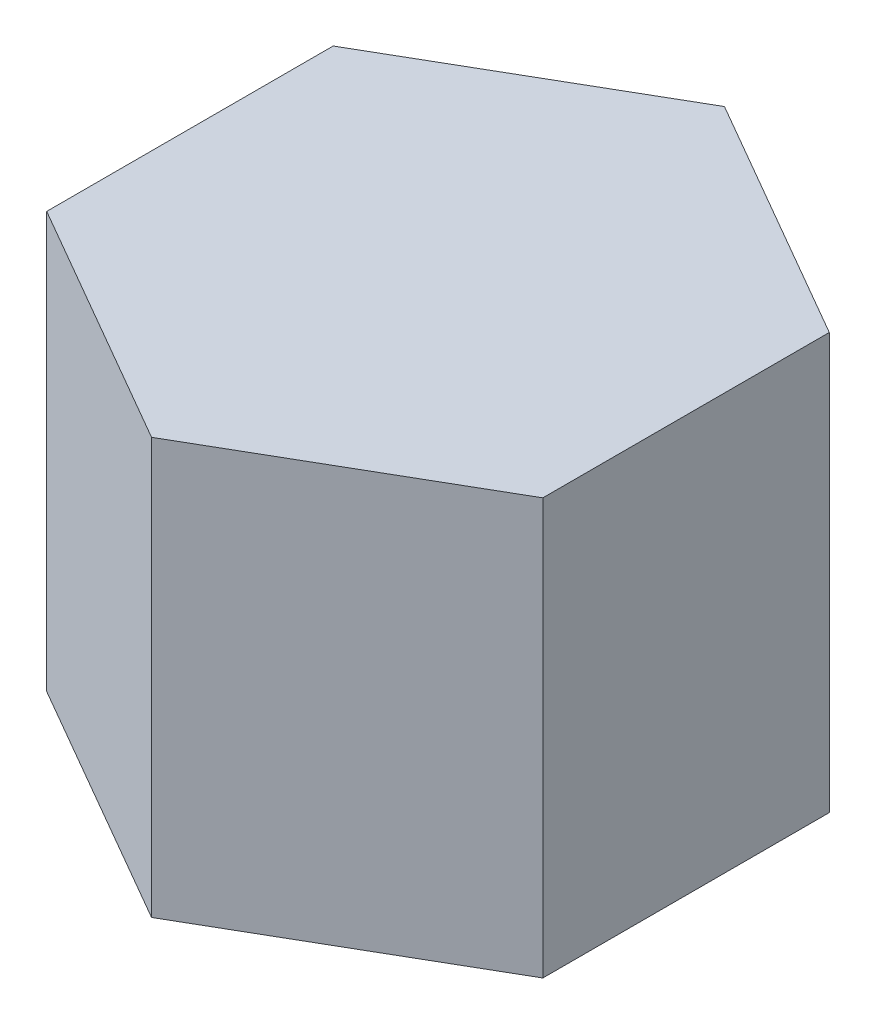
ISO-10303-21;
HEADER;
FILE_DESCRIPTION(('STEP AP214'),'2;1');
FILE_NAME('part.step','',(''),(''),'','','');
FILE_SCHEMA(('AUTOMOTIVE_DESIGN { 1 0 10303 214 1 1 1 1 }'));
ENDSEC;
DATA;
#1=APPLICATION_CONTEXT('core data for automotive mechanical design processes');
#2=APPLICATION_PROTOCOL_DEFINITION('international standard','automotive_design',2000,#1);
#3=PRODUCT_CONTEXT('',#1,'mechanical');
#4=PRODUCT('Part','Part','',(#3));
#5=PRODUCT_RELATED_PRODUCT_CATEGORY('part','',(#4));
#6=PRODUCT_DEFINITION_FORMATION('','',#4);
#7=PRODUCT_DEFINITION_CONTEXT('part definition',#1,'design');
#8=PRODUCT_DEFINITION('design','',#6,#7);
#9=PRODUCT_DEFINITION_SHAPE('','',#8);
#10=(LENGTH_UNIT() NAMED_UNIT(*) SI_UNIT(.MILLI.,.METRE.));
#11=(NAMED_UNIT(*) PLANE_ANGLE_UNIT() SI_UNIT($,.RADIAN.));
#12=(NAMED_UNIT(*) SI_UNIT($,.STERADIAN.) SOLID_ANGLE_UNIT());
#13=UNCERTAINTY_MEASURE_WITH_UNIT(LENGTH_MEASURE(1.E-05),#10,'distance_accuracy_value','');
#14=(GEOMETRIC_REPRESENTATION_CONTEXT(3) GLOBAL_UNCERTAINTY_ASSIGNED_CONTEXT((#13)) GLOBAL_UNIT_ASSIGNED_CONTEXT((#10,
#11,#12)) REPRESENTATION_CONTEXT('',''));
#15=CARTESIAN_POINT('',(0.,0.,0.));
#16=DIRECTION('',(0.,0.,1.));
#17=DIRECTION('',(1.,0.,0.));
#18=AXIS2_PLACEMENT_3D('',#15,#16,#17);
#19=CARTESIAN_POINT('',(205.142660308706,-148.537700895744,287.176844201572));
#20=DIRECTION('',(-0.499999999999943,0.,-0.866025403784472));
#21=DIRECTION('',(-0.866025403784472,0.,0.499999999999943));
#22=AXIS2_PLACEMENT_3D('',#19,#20,#21);
#23=PLANE('',#22);
#24=CARTESIAN_POINT('',(204.839551417382,-149.045793579175,287.351844201572));
#25=DIRECTION('',(0.866025403784471,0.,-0.499999999999943));
#26=VECTOR('',#25,1.);
#27=LINE('',#24,#26);
#28=CARTESIAN_POINT('',(204.839551417382,-149.045793579175,287.351844201572));
#29=VERTEX_POINT('',#28);
#30=CARTESIAN_POINT('',(205.142660308706,-149.045793579175,287.176844201572));
#31=VERTEX_POINT('',#30);
#32=EDGE_CURVE('E170',#29,#31,#27,.T.);
#33=ORIENTED_EDGE('',*,*,#32,.T.);
#34=CARTESIAN_POINT('',(205.142660308706,-148.537700895744,287.176844201572));
#35=DIRECTION('',(0.,-1.,0.));
#36=VECTOR('',#35,1.);
#37=LINE('',#34,#36);
#38=CARTESIAN_POINT('',(205.142660308706,-148.537700895744,287.176844201572));
#39=VERTEX_POINT('',#38);
#40=EDGE_CURVE('E35',#39,#31,#37,.T.);
#41=ORIENTED_EDGE('',*,*,#40,.F.);
#42=CARTESIAN_POINT('',(204.839551417382,-148.537700895744,287.351844201572));
#43=DIRECTION('',(0.866025403784471,0.,-0.499999999999943));
#44=VECTOR('',#43,1.);
#45=LINE('',#42,#44);
#46=CARTESIAN_POINT('',(204.839551417382,-148.537700895744,287.351844201572));
#47=VERTEX_POINT('',#46);
#48=EDGE_CURVE('E159',#47,#39,#45,.T.);
#49=ORIENTED_EDGE('',*,*,#48,.F.);
#50=CARTESIAN_POINT('',(204.839551417382,-148.537700895744,287.351844201572));
#51=DIRECTION('',(0.,-1.,0.));
#52=VECTOR('',#51,1.);
#53=LINE('',#50,#52);
#54=EDGE_CURVE('E10',#47,#29,#53,.T.);
#55=ORIENTED_EDGE('',*,*,#54,.T.);
#56=EDGE_LOOP('',(#33,#41,#49,#55));
#57=FACE_BOUND('',#56,.T.);
#58=ADVANCED_FACE('F16',(#57),#23,.F.);
#59=CARTESIAN_POINT('',(204.839551417382,-148.537700895744,287.351844201572));
#60=DIRECTION('',(0.500000000000062,0.,-0.866025403784403));
#61=DIRECTION('',(-0.866025403784403,0.,-0.500000000000062));
#62=AXIS2_PLACEMENT_3D('',#59,#60,#61);
#63=PLANE('',#62);
#64=CARTESIAN_POINT('',(204.536442526057,-149.045793579175,287.176844201572));
#65=DIRECTION('',(0.866025403784403,0.,0.500000000000062));
#66=VECTOR('',#65,1.);
#67=LINE('',#64,#66);
#68=CARTESIAN_POINT('',(204.536442526057,-149.045793579175,287.176844201572));
#69=VERTEX_POINT('',#68);
#70=EDGE_CURVE('E167',#69,#29,#67,.T.);
#71=ORIENTED_EDGE('',*,*,#70,.T.);
#72=ORIENTED_EDGE('',*,*,#54,.F.);
#73=CARTESIAN_POINT('',(204.536442526057,-148.537700895744,287.176844201572));
#74=DIRECTION('',(0.866025403784403,0.,0.500000000000062));
#75=VECTOR('',#74,1.);
#76=LINE('',#73,#75);
#77=CARTESIAN_POINT('',(204.536442526057,-148.537700895744,287.176844201572));
#78=VERTEX_POINT('',#77);
#79=EDGE_CURVE('E156',#78,#47,#76,.T.);
#80=ORIENTED_EDGE('',*,*,#79,.F.);
#81=CARTESIAN_POINT('',(204.536442526057,-148.537700895744,287.176844201572));
#82=DIRECTION('',(0.,-1.,0.));
#83=VECTOR('',#82,1.);
#84=LINE('',#81,#83);
#85=EDGE_CURVE('E27',#78,#69,#84,.T.);
#86=ORIENTED_EDGE('',*,*,#85,.T.);
#87=EDGE_LOOP('',(#71,#72,#80,#86));
#88=FACE_BOUND('',#87,.T.);
#89=ADVANCED_FACE('F189',(#88),#63,.F.);
#90=CARTESIAN_POINT('',(204.536442526057,-148.537700895744,290.831971220494));
#91=DIRECTION('',(1.,0.,0.));
#92=DIRECTION('',(0.,1.,0.));
#93=AXIS2_PLACEMENT_3D('',#90,#91,#92);
#94=PLANE('',#93);
#95=CARTESIAN_POINT('',(204.536442526057,-149.045793579175,286.826844201572));
#96=DIRECTION('',(0.,0.,1.));
#97=VECTOR('',#96,1.);
#98=LINE('',#95,#97);
#99=CARTESIAN_POINT('',(204.536442526057,-149.045793579175,286.826844201572));
#100=VERTEX_POINT('',#99);
#101=EDGE_CURVE('E163',#100,#69,#98,.T.);
#102=ORIENTED_EDGE('',*,*,#101,.T.);
#103=ORIENTED_EDGE('',*,*,#85,.F.);
#104=CARTESIAN_POINT('',(204.536442526057,-148.537700895744,286.826844201572));
#105=DIRECTION('',(0.,0.,1.));
#106=VECTOR('',#105,1.);
#107=LINE('',#104,#106);
#108=CARTESIAN_POINT('',(204.536442526057,-148.537700895744,286.826844201572));
#109=VERTEX_POINT('',#108);
#110=EDGE_CURVE('E106',#109,#78,#107,.T.);
#111=ORIENTED_EDGE('',*,*,#110,.F.);
#112=CARTESIAN_POINT('',(204.536442526057,-148.537700895744,286.826844201572));
#113=DIRECTION('',(0.,-1.,0.));
#114=VECTOR('',#113,1.);
#115=LINE('',#112,#114);
#116=EDGE_CURVE('E94',#109,#100,#115,.T.);
#117=ORIENTED_EDGE('',*,*,#116,.T.);
#118=EDGE_LOOP('',(#102,#103,#111,#117));
#119=FACE_BOUND('',#118,.T.);
#120=ADVANCED_FACE('F198',(#119),#94,.F.);
#121=CARTESIAN_POINT('',(204.536442526057,-148.537700895744,286.826844201572));
#122=DIRECTION('',(0.499999999999978,0.,0.866025403784452));
#123=DIRECTION('',(0.866025403784452,0.,-0.499999999999978));
#124=AXIS2_PLACEMENT_3D('',#121,#122,#123);
#125=PLANE('',#124);
#126=CARTESIAN_POINT('',(204.839551417382,-149.045793579175,286.651844201572));
#127=DIRECTION('',(-0.866025403784452,0.,0.499999999999978));
#128=VECTOR('',#127,1.);
#129=LINE('',#126,#128);
#130=CARTESIAN_POINT('',(204.839551417382,-149.045793579175,286.651844201572));
#131=VERTEX_POINT('',#130);
#132=EDGE_CURVE('E162',#131,#100,#129,.T.);
#133=ORIENTED_EDGE('',*,*,#132,.T.);
#134=ORIENTED_EDGE('',*,*,#116,.F.);
#135=CARTESIAN_POINT('',(204.839551417382,-148.537700895744,286.651844201572));
#136=DIRECTION('',(-0.866025403784452,0.,0.499999999999978));
#137=VECTOR('',#136,1.);
#138=LINE('',#135,#137);
#139=CARTESIAN_POINT('',(204.839551417382,-148.537700895744,286.651844201572));
#140=VERTEX_POINT('',#139);
#141=EDGE_CURVE('E98',#140,#109,#138,.T.);
#142=ORIENTED_EDGE('',*,*,#141,.F.);
#143=CARTESIAN_POINT('',(204.839551417382,-148.537700895744,286.651844201572));
#144=DIRECTION('',(0.,-1.,0.));
#145=VECTOR('',#144,1.);
#146=LINE('',#143,#145);
#147=EDGE_CURVE('E79',#140,#131,#146,.T.);
#148=ORIENTED_EDGE('',*,*,#147,.T.);
#149=EDGE_LOOP('',(#133,#134,#142,#148));
#150=FACE_BOUND('',#149,.T.);
#151=ADVANCED_FACE('F100',(#150),#125,.F.);
#152=CARTESIAN_POINT('',(204.839551417382,-148.537700895744,286.651844201572));
#153=DIRECTION('',(-0.499999999999978,0.,0.866025403784452));
#154=DIRECTION('',(0.866025403784452,0.,0.499999999999978));
#155=AXIS2_PLACEMENT_3D('',#152,#153,#154);
#156=PLANE('',#155);
#157=CARTESIAN_POINT('',(205.142660308706,-149.045793579175,286.826844201572));
#158=DIRECTION('',(-0.866025403784452,0.,-0.499999999999978));
#159=VECTOR('',#158,1.);
#160=LINE('',#157,#159);
#161=CARTESIAN_POINT('',(205.142660308706,-149.045793579175,286.826844201572));
#162=VERTEX_POINT('',#161);
#163=EDGE_CURVE('E88',#162,#131,#160,.T.);
#164=ORIENTED_EDGE('',*,*,#163,.T.);
#165=ORIENTED_EDGE('',*,*,#147,.F.);
#166=CARTESIAN_POINT('',(205.142660308706,-148.537700895744,286.826844201572));
#167=DIRECTION('',(-0.866025403784452,0.,-0.499999999999978));
#168=VECTOR('',#167,1.);
#169=LINE('',#166,#168);
#170=CARTESIAN_POINT('',(205.142660308706,-148.537700895744,286.826844201572));
#171=VERTEX_POINT('',#170);
#172=EDGE_CURVE('E84',#171,#140,#169,.T.);
#173=ORIENTED_EDGE('',*,*,#172,.F.);
#174=CARTESIAN_POINT('',(205.142660308706,-148.537700895744,286.826844201572));
#175=DIRECTION('',(0.,-1.,0.));
#176=VECTOR('',#175,1.);
#177=LINE('',#174,#176);
#178=EDGE_CURVE('E58',#171,#162,#177,.T.);
#179=ORIENTED_EDGE('',*,*,#178,.T.);
#180=EDGE_LOOP('',(#164,#165,#173,#179));
#181=FACE_BOUND('',#180,.T.);
#182=ADVANCED_FACE('F82',(#181),#156,.F.);
#183=CARTESIAN_POINT('',(205.142660308706,-148.537700895744,290.831971220494));
#184=DIRECTION('',(-1.,0.,0.));
#185=DIRECTION('',(0.,-1.,0.));
#186=AXIS2_PLACEMENT_3D('',#183,#184,#185);
#187=PLANE('',#186);
#188=CARTESIAN_POINT('',(205.142660308706,-149.045793579175,287.176844201572));
#189=DIRECTION('',(0.,0.,-1.));
#190=VECTOR('',#189,1.);
#191=LINE('',#188,#190);
#192=EDGE_CURVE('E160',#31,#162,#191,.T.);
#193=ORIENTED_EDGE('',*,*,#192,.T.);
#194=ORIENTED_EDGE('',*,*,#178,.F.);
#195=CARTESIAN_POINT('',(205.142660308706,-148.537700895744,287.176844201572));
#196=DIRECTION('',(0.,0.,-1.));
#197=VECTOR('',#196,1.);
#198=LINE('',#195,#197);
#199=EDGE_CURVE('E112',#39,#171,#198,.T.);
#200=ORIENTED_EDGE('',*,*,#199,.F.);
#201=ORIENTED_EDGE('',*,*,#40,.T.);
#202=EDGE_LOOP('',(#193,#194,#200,#201));
#203=FACE_BOUND('',#202,.T.);
#204=ADVANCED_FACE('F131',(#203),#187,.F.);
#205=CARTESIAN_POINT('',(206.339551417382,-148.537700895744,290.831971220494));
#206=DIRECTION('',(0.,-1.,0.));
#207=DIRECTION('',(1.,0.,0.));
#208=AXIS2_PLACEMENT_3D('',#205,#206,#207);
#209=PLANE('',#208);
#210=ORIENTED_EDGE('',*,*,#48,.T.);
#211=ORIENTED_EDGE('',*,*,#199,.T.);
#212=ORIENTED_EDGE('',*,*,#172,.T.);
#213=ORIENTED_EDGE('',*,*,#141,.T.);
#214=ORIENTED_EDGE('',*,*,#110,.T.);
#215=ORIENTED_EDGE('',*,*,#79,.T.);
#216=EDGE_LOOP('',(#210,#211,#212,#213,#214,#215));
#217=FACE_BOUND('',#216,.T.);
#218=ADVANCED_FACE('F111',(#217),#209,.F.);
#219=CARTESIAN_POINT('',(206.339551417382,-149.045793579175,290.831971220494));
#220=DIRECTION('',(0.,-1.,0.));
#221=DIRECTION('',(1.,0.,0.));
#222=AXIS2_PLACEMENT_3D('',#219,#220,#221);
#223=PLANE('',#222);
#224=ORIENTED_EDGE('',*,*,#32,.F.);
#225=ORIENTED_EDGE('',*,*,#70,.F.);
#226=ORIENTED_EDGE('',*,*,#101,.F.);
#227=ORIENTED_EDGE('',*,*,#132,.F.);
#228=ORIENTED_EDGE('',*,*,#163,.F.);
#229=ORIENTED_EDGE('',*,*,#192,.F.);
#230=EDGE_LOOP('',(#224,#225,#226,#227,#228,#229));
#231=FACE_BOUND('',#230,.T.);
#232=ADVANCED_FACE('F130',(#231),#223,.T.);
#233=CLOSED_SHELL('',(#58,#89,#120,#151,#182,#204,#218,#232));
#234=MANIFOLD_SOLID_BREP('B1',#233);
#235=ADVANCED_BREP_SHAPE_REPRESENTATION('',(#18,#234),#14);
#236=SHAPE_DEFINITION_REPRESENTATION(#9,#235);
ENDSEC;
END-ISO-10303-21;
